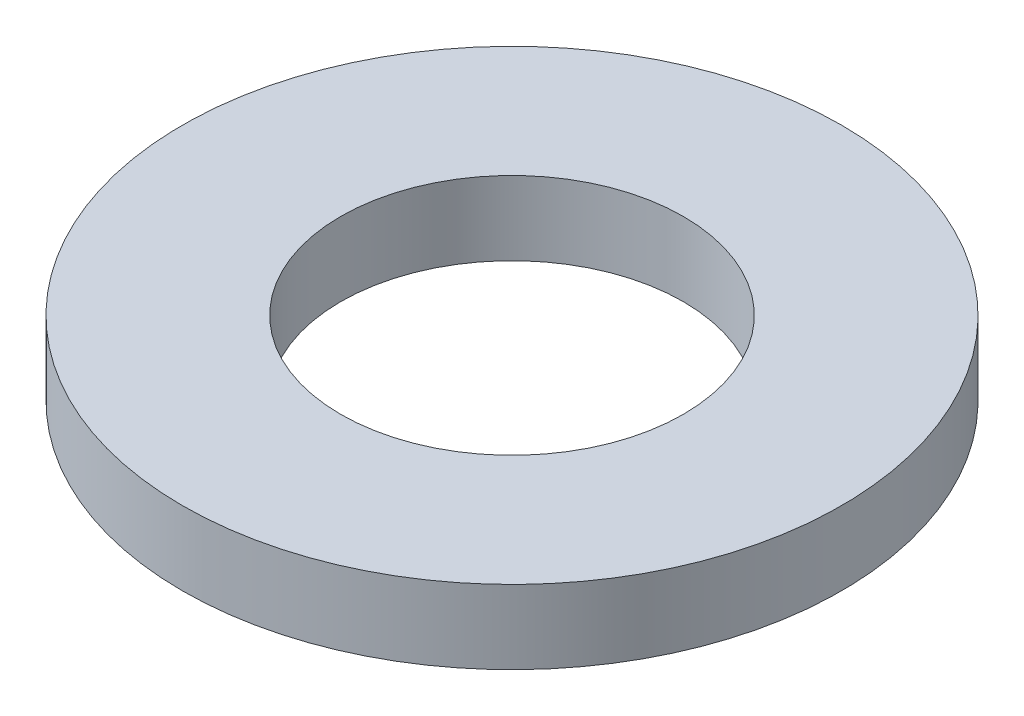
ISO-10303-21;
HEADER;
FILE_DESCRIPTION(('STEP AP214'),'2;1');
FILE_NAME('part.step','',(''),(''),'','','');
FILE_SCHEMA(('AUTOMOTIVE_DESIGN { 1 0 10303 214 1 1 1 1 }'));
ENDSEC;
DATA;
#1=APPLICATION_CONTEXT('core data for automotive mechanical design processes');
#2=APPLICATION_PROTOCOL_DEFINITION('international standard','automotive_design',2000,#1);
#3=PRODUCT_CONTEXT('',#1,'mechanical');
#4=PRODUCT('Part','Part','',(#3));
#5=PRODUCT_RELATED_PRODUCT_CATEGORY('part','',(#4));
#6=PRODUCT_DEFINITION_FORMATION('','',#4);
#7=PRODUCT_DEFINITION_CONTEXT('part definition',#1,'design');
#8=PRODUCT_DEFINITION('design','',#6,#7);
#9=PRODUCT_DEFINITION_SHAPE('','',#8);
#10=(LENGTH_UNIT() NAMED_UNIT(*) SI_UNIT(.MILLI.,.METRE.));
#11=(NAMED_UNIT(*) PLANE_ANGLE_UNIT() SI_UNIT($,.RADIAN.));
#12=(NAMED_UNIT(*) SI_UNIT($,.STERADIAN.) SOLID_ANGLE_UNIT());
#13=UNCERTAINTY_MEASURE_WITH_UNIT(LENGTH_MEASURE(1.E-05),#10,'distance_accuracy_value','');
#14=(GEOMETRIC_REPRESENTATION_CONTEXT(3) GLOBAL_UNCERTAINTY_ASSIGNED_CONTEXT((#13)) GLOBAL_UNIT_ASSIGNED_CONTEXT((#10,
#11,#12)) REPRESENTATION_CONTEXT('',''));
#15=CARTESIAN_POINT('',(0.,0.,0.));
#16=DIRECTION('',(0.,0.,1.));
#17=DIRECTION('',(1.,0.,0.));
#18=AXIS2_PLACEMENT_3D('',#15,#16,#17);
#19=CARTESIAN_POINT('',(0.,14.,0.));
#20=DIRECTION('',(0.,-1.,0.));
#21=DIRECTION('',(0.,0.,-1.));
#22=AXIS2_PLACEMENT_3D('',#19,#20,#21);
#23=CYLINDRICAL_SURFACE('',#22,62.5);
#24=CARTESIAN_POINT('',(0.,14.,0.));
#25=DIRECTION('',(0.,1.,0.));
#26=DIRECTION('',(0.,0.,1.));
#27=AXIS2_PLACEMENT_3D('',#24,#25,#26);
#28=CIRCLE('',#27,62.5);
#29=CARTESIAN_POINT('',(0.,14.,62.5));
#30=VERTEX_POINT('',#29);
#31=EDGE_CURVE('E10',#30,#30,#28,.T.);
#32=ORIENTED_EDGE('',*,*,#31,.F.);
#33=EDGE_LOOP('',(#32));
#34=FACE_BOUND('',#33,.T.);
#35=CARTESIAN_POINT('',(0.,0.,0.));
#36=DIRECTION('',(0.,1.,0.));
#37=DIRECTION('',(0.,0.,1.));
#38=AXIS2_PLACEMENT_3D('',#35,#36,#37);
#39=CIRCLE('',#38,62.5);
#40=CARTESIAN_POINT('',(0.,0.,62.5));
#41=VERTEX_POINT('',#40);
#42=EDGE_CURVE('E37',#41,#41,#39,.T.);
#43=ORIENTED_EDGE('',*,*,#42,.T.);
#44=EDGE_LOOP('',(#43));
#45=FACE_BOUND('',#44,.T.);
#46=ADVANCED_FACE('F40',(#34,#45),#23,.T.);
#47=CARTESIAN_POINT('',(0.,14.,0.));
#48=DIRECTION('',(0.,1.,0.));
#49=DIRECTION('',(0.,0.,1.));
#50=AXIS2_PLACEMENT_3D('',#47,#48,#49);
#51=PLANE('',#50);
#52=CARTESIAN_POINT('',(0.,14.,0.));
#53=DIRECTION('',(0.,1.,0.));
#54=DIRECTION('',(0.,0.,1.));
#55=AXIS2_PLACEMENT_3D('',#52,#53,#54);
#56=CIRCLE('',#55,32.5);
#57=CARTESIAN_POINT('',(0.,14.,32.5));
#58=VERTEX_POINT('',#57);
#59=EDGE_CURVE('E50',#58,#58,#56,.T.);
#60=ORIENTED_EDGE('',*,*,#59,.F.);
#61=EDGE_LOOP('',(#60));
#62=FACE_BOUND('',#61,.T.);
#63=ORIENTED_EDGE('',*,*,#31,.T.);
#64=EDGE_LOOP('',(#63));
#65=FACE_BOUND('',#64,.T.);
#66=ADVANCED_FACE('F59',(#62,#65),#51,.T.);
#67=CARTESIAN_POINT('',(0.,0.,0.));
#68=DIRECTION('',(0.,1.,0.));
#69=DIRECTION('',(0.,0.,1.));
#70=AXIS2_PLACEMENT_3D('',#67,#68,#69);
#71=PLANE('',#70);
#72=CARTESIAN_POINT('',(0.,0.,0.));
#73=DIRECTION('',(0.,1.,0.));
#74=DIRECTION('',(0.,0.,1.));
#75=AXIS2_PLACEMENT_3D('',#72,#73,#74);
#76=CIRCLE('',#75,32.5);
#77=CARTESIAN_POINT('',(0.,0.,32.5));
#78=VERTEX_POINT('',#77);
#79=EDGE_CURVE('E47',#78,#78,#76,.T.);
#80=ORIENTED_EDGE('',*,*,#79,.T.);
#81=EDGE_LOOP('',(#80));
#82=FACE_BOUND('',#81,.T.);
#83=ORIENTED_EDGE('',*,*,#42,.F.);
#84=EDGE_LOOP('',(#83));
#85=FACE_BOUND('',#84,.T.);
#86=ADVANCED_FACE('F58',(#82,#85),#71,.F.);
#87=CARTESIAN_POINT('',(0.,14.,0.));
#88=DIRECTION('',(0.,-1.,0.));
#89=DIRECTION('',(0.,0.,-1.));
#90=AXIS2_PLACEMENT_3D('',#87,#88,#89);
#91=CYLINDRICAL_SURFACE('',#90,32.5);
#92=ORIENTED_EDGE('',*,*,#59,.T.);
#93=EDGE_LOOP('',(#92));
#94=FACE_BOUND('',#93,.T.);
#95=ORIENTED_EDGE('',*,*,#79,.F.);
#96=EDGE_LOOP('',(#95));
#97=FACE_BOUND('',#96,.T.);
#98=ADVANCED_FACE('F54',(#94,#97),#91,.F.);
#99=CLOSED_SHELL('',(#46,#66,#86,#98));
#100=MANIFOLD_SOLID_BREP('B2',#99);
#101=ADVANCED_BREP_SHAPE_REPRESENTATION('',(#18,#100),#14);
#102=SHAPE_DEFINITION_REPRESENTATION(#9,#101);
ENDSEC;
END-ISO-10303-21;
